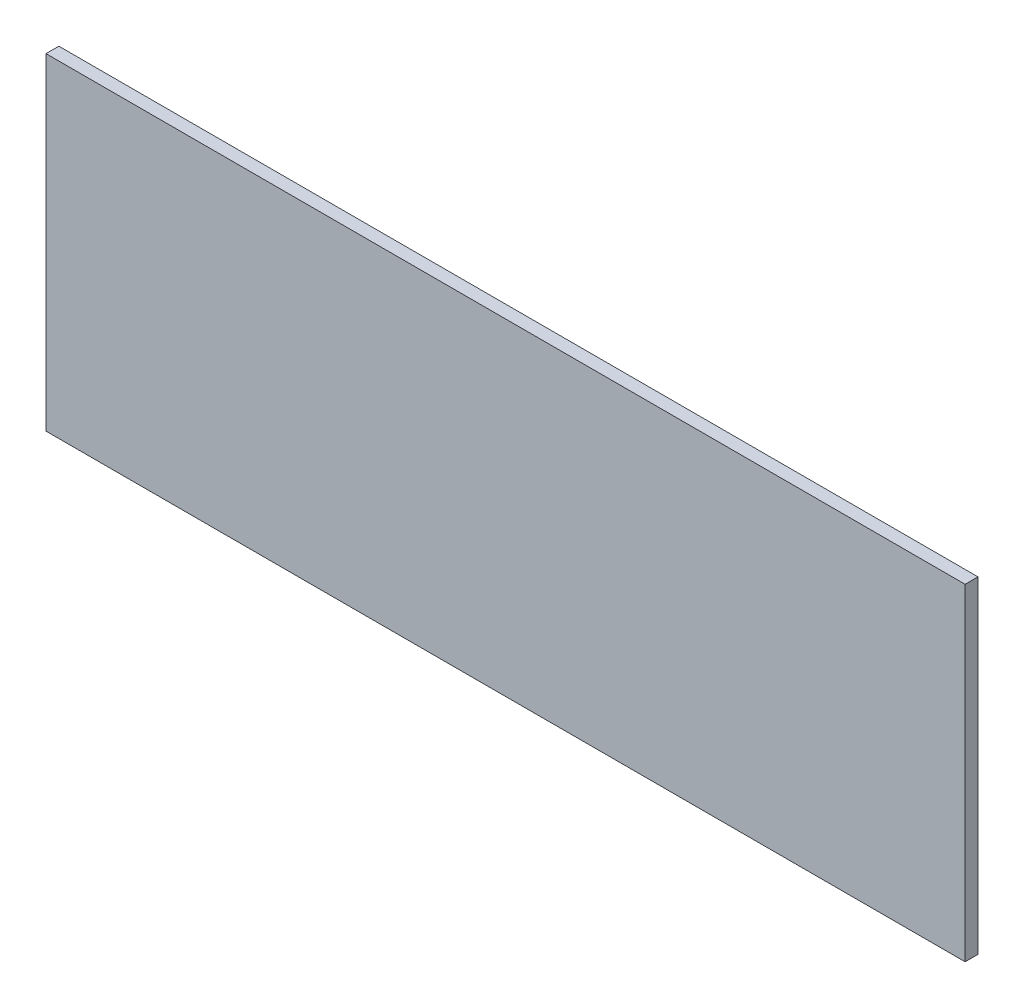
ISO-10303-21;
HEADER;
FILE_DESCRIPTION(('STEP AP214'),'2;1');
FILE_NAME('part.step','',(''),(''),'','','');
FILE_SCHEMA(('AUTOMOTIVE_DESIGN { 1 0 10303 214 1 1 1 1 }'));
ENDSEC;
DATA;
#1=APPLICATION_CONTEXT('core data for automotive mechanical design processes');
#2=APPLICATION_PROTOCOL_DEFINITION('international standard','automotive_design',2000,#1);
#3=PRODUCT_CONTEXT('',#1,'mechanical');
#4=PRODUCT('Part','Part','',(#3));
#5=PRODUCT_RELATED_PRODUCT_CATEGORY('part','',(#4));
#6=PRODUCT_DEFINITION_FORMATION('','',#4);
#7=PRODUCT_DEFINITION_CONTEXT('part definition',#1,'design');
#8=PRODUCT_DEFINITION('design','',#6,#7);
#9=PRODUCT_DEFINITION_SHAPE('','',#8);
#10=(LENGTH_UNIT() NAMED_UNIT(*) SI_UNIT(.MILLI.,.METRE.));
#11=(NAMED_UNIT(*) PLANE_ANGLE_UNIT() SI_UNIT($,.RADIAN.));
#12=(NAMED_UNIT(*) SI_UNIT($,.STERADIAN.) SOLID_ANGLE_UNIT());
#13=UNCERTAINTY_MEASURE_WITH_UNIT(LENGTH_MEASURE(1.E-05),#10,'distance_accuracy_value','');
#14=(GEOMETRIC_REPRESENTATION_CONTEXT(3) GLOBAL_UNCERTAINTY_ASSIGNED_CONTEXT((#13)) GLOBAL_UNIT_ASSIGNED_CONTEXT((#10,
#11,#12)) REPRESENTATION_CONTEXT('',''));
#15=CARTESIAN_POINT('',(0.,0.,0.));
#16=DIRECTION('',(0.,0.,1.));
#17=DIRECTION('',(1.,0.,0.));
#18=AXIS2_PLACEMENT_3D('',#15,#16,#17);
#19=CARTESIAN_POINT('',(0.,0.,1.5));
#20=DIRECTION('',(1.,0.,0.));
#21=DIRECTION('',(0.,0.,-1.));
#22=AXIS2_PLACEMENT_3D('',#19,#20,#21);
#23=PLANE('',#22);
#24=DIRECTION('',(0.,-1.,0.));
#25=VECTOR('',#24,1.);
#26=CARTESIAN_POINT('',(0.,0.,-1.5));
#27=LINE('',#26,#25);
#28=CARTESIAN_POINT('',(0.,76.2,-1.5));
#29=VERTEX_POINT('',#28);
#30=CARTESIAN_POINT('',(0.,0.,-1.5));
#31=VERTEX_POINT('',#30);
#32=EDGE_CURVE('E95',#29,#31,#27,.T.);
#33=ORIENTED_EDGE('',*,*,#32,.T.);
#34=DIRECTION('',(0.,0.,-1.));
#35=VECTOR('',#34,1.);
#36=CARTESIAN_POINT('',(0.,0.,1.5));
#37=LINE('',#36,#35);
#38=CARTESIAN_POINT('',(0.,0.,1.5));
#39=VERTEX_POINT('',#38);
#40=EDGE_CURVE('E11',#39,#31,#37,.T.);
#41=ORIENTED_EDGE('',*,*,#40,.F.);
#42=DIRECTION('',(0.,-1.,0.));
#43=VECTOR('',#42,1.);
#44=CARTESIAN_POINT('',(0.,0.,1.5));
#45=LINE('',#44,#43);
#46=CARTESIAN_POINT('',(0.,76.2,1.5));
#47=VERTEX_POINT('',#46);
#48=EDGE_CURVE('E83',#47,#39,#45,.T.);
#49=ORIENTED_EDGE('',*,*,#48,.F.);
#50=DIRECTION('',(0.,0.,-1.));
#51=VECTOR('',#50,1.);
#52=CARTESIAN_POINT('',(0.,76.2,1.5));
#53=LINE('',#52,#51);
#54=EDGE_CURVE('E91',#47,#29,#53,.T.);
#55=ORIENTED_EDGE('',*,*,#54,.T.);
#56=EDGE_LOOP('',(#33,#41,#49,#55));
#57=FACE_BOUND('',#56,.T.);
#58=ADVANCED_FACE('F32',(#57),#23,.F.);
#59=CARTESIAN_POINT('',(0.,0.,1.5));
#60=DIRECTION('',(0.,1.,0.));
#61=DIRECTION('',(0.,0.,1.));
#62=AXIS2_PLACEMENT_3D('',#59,#60,#61);
#63=PLANE('',#62);
#64=DIRECTION('',(1.,0.,0.));
#65=VECTOR('',#64,1.);
#66=CARTESIAN_POINT('',(0.,0.,-1.5));
#67=LINE('',#66,#65);
#68=CARTESIAN_POINT('',(214.216,0.,-1.5));
#69=VERTEX_POINT('',#68);
#70=EDGE_CURVE('E87',#31,#69,#67,.T.);
#71=ORIENTED_EDGE('',*,*,#70,.T.);
#72=DIRECTION('',(0.,0.,-1.));
#73=VECTOR('',#72,1.);
#74=CARTESIAN_POINT('',(214.216,0.,1.5));
#75=LINE('',#74,#73);
#76=CARTESIAN_POINT('',(214.216,0.,1.5));
#77=VERTEX_POINT('',#76);
#78=EDGE_CURVE('E40',#77,#69,#75,.T.);
#79=ORIENTED_EDGE('',*,*,#78,.F.);
#80=DIRECTION('',(1.,0.,0.));
#81=VECTOR('',#80,1.);
#82=CARTESIAN_POINT('',(0.,0.,1.5));
#83=LINE('',#82,#81);
#84=EDGE_CURVE('E78',#39,#77,#83,.T.);
#85=ORIENTED_EDGE('',*,*,#84,.F.);
#86=ORIENTED_EDGE('',*,*,#40,.T.);
#87=EDGE_LOOP('',(#71,#79,#85,#86));
#88=FACE_BOUND('',#87,.T.);
#89=ADVANCED_FACE('F86',(#88),#63,.F.);
#90=CARTESIAN_POINT('',(214.216,0.,1.5));
#91=DIRECTION('',(-1.,0.,0.));
#92=DIRECTION('',(0.,0.,1.));
#93=AXIS2_PLACEMENT_3D('',#90,#91,#92);
#94=PLANE('',#93);
#95=DIRECTION('',(0.,1.,0.));
#96=VECTOR('',#95,1.);
#97=CARTESIAN_POINT('',(214.216,0.,-1.5));
#98=LINE('',#97,#96);
#99=CARTESIAN_POINT('',(214.216,76.2,-1.5));
#100=VERTEX_POINT('',#99);
#101=EDGE_CURVE('E65',#69,#100,#98,.T.);
#102=ORIENTED_EDGE('',*,*,#101,.T.);
#103=DIRECTION('',(0.,0.,-1.));
#104=VECTOR('',#103,1.);
#105=CARTESIAN_POINT('',(214.216,76.2,1.5));
#106=LINE('',#105,#104);
#107=CARTESIAN_POINT('',(214.216,76.2,1.5));
#108=VERTEX_POINT('',#107);
#109=EDGE_CURVE('E88',#108,#100,#106,.T.);
#110=ORIENTED_EDGE('',*,*,#109,.F.);
#111=DIRECTION('',(0.,1.,0.));
#112=VECTOR('',#111,1.);
#113=CARTESIAN_POINT('',(214.216,0.,1.5));
#114=LINE('',#113,#112);
#115=EDGE_CURVE('E81',#77,#108,#114,.T.);
#116=ORIENTED_EDGE('',*,*,#115,.F.);
#117=ORIENTED_EDGE('',*,*,#78,.T.);
#118=EDGE_LOOP('',(#102,#110,#116,#117));
#119=FACE_BOUND('',#118,.T.);
#120=ADVANCED_FACE('F89',(#119),#94,.F.);
#121=CARTESIAN_POINT('',(0.,76.2,1.5));
#122=DIRECTION('',(0.,-1.,0.));
#123=DIRECTION('',(0.,0.,-1.));
#124=AXIS2_PLACEMENT_3D('',#121,#122,#123);
#125=PLANE('',#124);
#126=DIRECTION('',(-1.,0.,0.));
#127=VECTOR('',#126,1.);
#128=CARTESIAN_POINT('',(0.,76.2,-1.5));
#129=LINE('',#128,#127);
#130=EDGE_CURVE('E71',#100,#29,#129,.T.);
#131=ORIENTED_EDGE('',*,*,#130,.T.);
#132=ORIENTED_EDGE('',*,*,#54,.F.);
#133=DIRECTION('',(-1.,0.,0.));
#134=VECTOR('',#133,1.);
#135=CARTESIAN_POINT('',(0.,76.2,1.5));
#136=LINE('',#135,#134);
#137=EDGE_CURVE('E48',#108,#47,#136,.T.);
#138=ORIENTED_EDGE('',*,*,#137,.F.);
#139=ORIENTED_EDGE('',*,*,#109,.T.);
#140=EDGE_LOOP('',(#131,#132,#138,#139));
#141=FACE_BOUND('',#140,.T.);
#142=ADVANCED_FACE('F102',(#141),#125,.F.);
#143=CARTESIAN_POINT('',(0.,0.,1.5));
#144=DIRECTION('',(0.,0.,-1.));
#145=DIRECTION('',(-1.,0.,0.));
#146=AXIS2_PLACEMENT_3D('',#143,#144,#145);
#147=PLANE('',#146);
#148=ORIENTED_EDGE('',*,*,#48,.T.);
#149=ORIENTED_EDGE('',*,*,#84,.T.);
#150=ORIENTED_EDGE('',*,*,#115,.T.);
#151=ORIENTED_EDGE('',*,*,#137,.T.);
#152=EDGE_LOOP('',(#148,#149,#150,#151));
#153=FACE_BOUND('',#152,.T.);
#154=ADVANCED_FACE('F79',(#153),#147,.F.);
#155=CARTESIAN_POINT('',(0.,0.,-1.5));
#156=DIRECTION('',(0.,0.,-1.));
#157=DIRECTION('',(-1.,0.,0.));
#158=AXIS2_PLACEMENT_3D('',#155,#156,#157);
#159=PLANE('',#158);
#160=ORIENTED_EDGE('',*,*,#32,.F.);
#161=ORIENTED_EDGE('',*,*,#130,.F.);
#162=ORIENTED_EDGE('',*,*,#101,.F.);
#163=ORIENTED_EDGE('',*,*,#70,.F.);
#164=EDGE_LOOP('',(#160,#161,#162,#163));
#165=FACE_BOUND('',#164,.T.);
#166=ADVANCED_FACE('F105',(#165),#159,.T.);
#167=CLOSED_SHELL('',(#58,#89,#120,#142,#154,#166));
#168=MANIFOLD_SOLID_BREP('B2',#167);
#169=ADVANCED_BREP_SHAPE_REPRESENTATION('',(#18,#168),#14);
#170=SHAPE_DEFINITION_REPRESENTATION(#9,#169);
ENDSEC;
END-ISO-10303-21;
